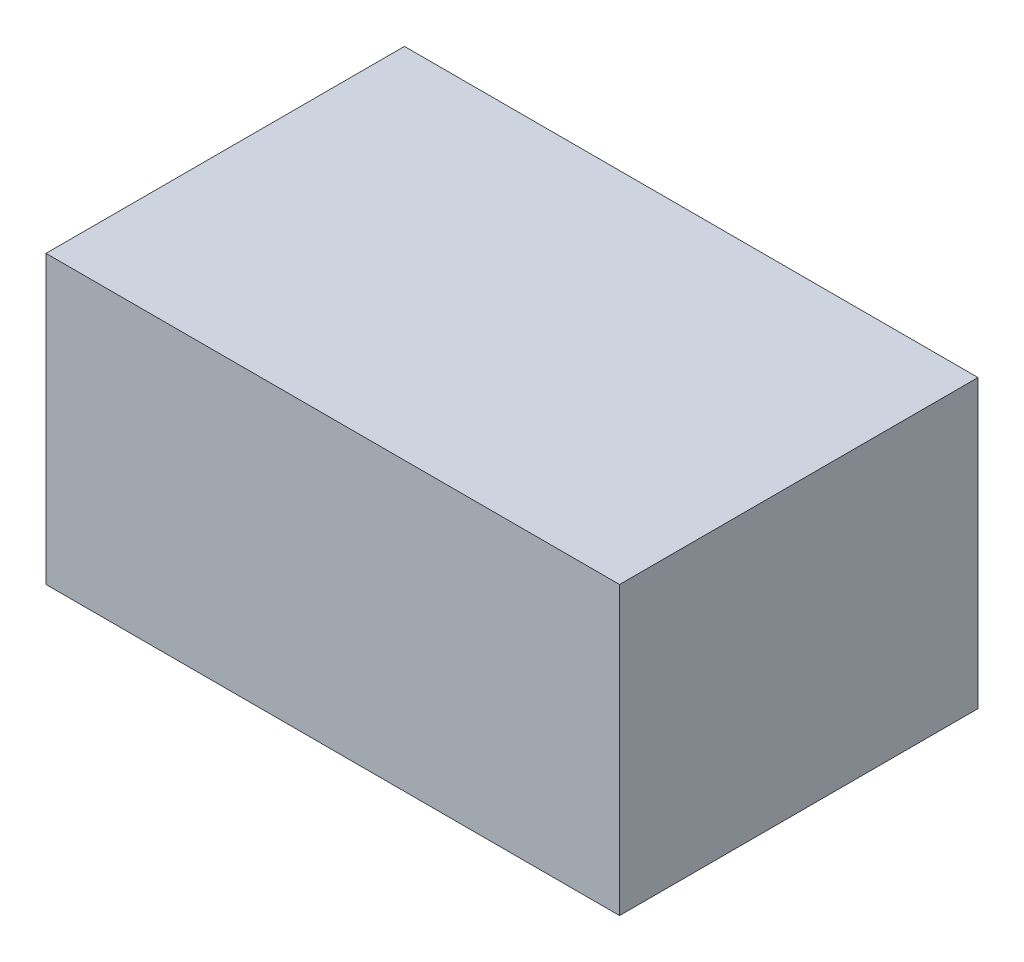
ISO-10303-21;
HEADER;
FILE_DESCRIPTION(('STEP AP214'),'2;1');
FILE_NAME('part.step','',(''),(''),'','','');
FILE_SCHEMA(('AUTOMOTIVE_DESIGN { 1 0 10303 214 1 1 1 1 }'));
ENDSEC;
DATA;
#1=APPLICATION_CONTEXT('core data for automotive mechanical design processes');
#2=APPLICATION_PROTOCOL_DEFINITION('international standard','automotive_design',2000,#1);
#3=PRODUCT_CONTEXT('',#1,'mechanical');
#4=PRODUCT('Part','Part','',(#3));
#5=PRODUCT_RELATED_PRODUCT_CATEGORY('part','',(#4));
#6=PRODUCT_DEFINITION_FORMATION('','',#4);
#7=PRODUCT_DEFINITION_CONTEXT('part definition',#1,'design');
#8=PRODUCT_DEFINITION('design','',#6,#7);
#9=PRODUCT_DEFINITION_SHAPE('','',#8);
#10=(LENGTH_UNIT() NAMED_UNIT(*) SI_UNIT(.MILLI.,.METRE.));
#11=(NAMED_UNIT(*) PLANE_ANGLE_UNIT() SI_UNIT($,.RADIAN.));
#12=(NAMED_UNIT(*) SI_UNIT($,.STERADIAN.) SOLID_ANGLE_UNIT());
#13=UNCERTAINTY_MEASURE_WITH_UNIT(LENGTH_MEASURE(1.E-05),#10,'distance_accuracy_value','');
#14=(GEOMETRIC_REPRESENTATION_CONTEXT(3) GLOBAL_UNCERTAINTY_ASSIGNED_CONTEXT((#13)) GLOBAL_UNIT_ASSIGNED_CONTEXT((#10,
#11,#12)) REPRESENTATION_CONTEXT('',''));
#15=CARTESIAN_POINT('',(0.,0.,0.));
#16=DIRECTION('',(0.,0.,1.));
#17=DIRECTION('',(1.,0.,0.));
#18=AXIS2_PLACEMENT_3D('',#15,#16,#17);
#19=CARTESIAN_POINT('',(-40.,40.,-25.));
#20=DIRECTION('',(1.,0.,0.));
#21=DIRECTION('',(0.,0.,-1.));
#22=AXIS2_PLACEMENT_3D('',#19,#20,#21);
#23=PLANE('',#22);
#24=DIRECTION('',(0.,0.,1.));
#25=VECTOR('',#24,1.);
#26=CARTESIAN_POINT('',(-40.,0.,-25.));
#27=LINE('',#26,#25);
#28=CARTESIAN_POINT('',(-40.,0.,-25.));
#29=VERTEX_POINT('',#28);
#30=CARTESIAN_POINT('',(-40.,0.,25.));
#31=VERTEX_POINT('',#30);
#32=EDGE_CURVE('E142',#29,#31,#27,.T.);
#33=ORIENTED_EDGE('',*,*,#32,.T.);
#34=DIRECTION('',(0.,-1.,0.));
#35=VECTOR('',#34,1.);
#36=CARTESIAN_POINT('',(-40.,40.,25.));
#37=LINE('',#36,#35);
#38=CARTESIAN_POINT('',(-40.,40.,25.));
#39=VERTEX_POINT('',#38);
#40=EDGE_CURVE('E11',#39,#31,#37,.T.);
#41=ORIENTED_EDGE('',*,*,#40,.F.);
#42=DIRECTION('',(0.,0.,1.));
#43=VECTOR('',#42,1.);
#44=CARTESIAN_POINT('',(-40.,40.,-25.));
#45=LINE('',#44,#43);
#46=CARTESIAN_POINT('',(-40.,40.,-25.));
#47=VERTEX_POINT('',#46);
#48=EDGE_CURVE('E146',#47,#39,#45,.T.);
#49=ORIENTED_EDGE('',*,*,#48,.F.);
#50=DIRECTION('',(0.,-1.,0.));
#51=VECTOR('',#50,1.);
#52=CARTESIAN_POINT('',(-40.,40.,-25.));
#53=LINE('',#52,#51);
#54=EDGE_CURVE('E152',#47,#29,#53,.T.);
#55=ORIENTED_EDGE('',*,*,#54,.T.);
#56=EDGE_LOOP('',(#33,#41,#49,#55));
#57=FACE_BOUND('',#56,.T.);
#58=ADVANCED_FACE('F34',(#57),#23,.F.);
#59=CARTESIAN_POINT('',(40.,40.,25.));
#60=DIRECTION('',(0.,0.,-1.));
#61=DIRECTION('',(-1.,0.,0.));
#62=AXIS2_PLACEMENT_3D('',#59,#60,#61);
#63=PLANE('',#62);
#64=DIRECTION('',(1.,0.,0.));
#65=VECTOR('',#64,1.);
#66=CARTESIAN_POINT('',(40.,0.,25.));
#67=LINE('',#66,#65);
#68=CARTESIAN_POINT('',(40.,0.,25.));
#69=VERTEX_POINT('',#68);
#70=EDGE_CURVE('E155',#31,#69,#67,.T.);
#71=ORIENTED_EDGE('',*,*,#70,.T.);
#72=DIRECTION('',(0.,-1.,0.));
#73=VECTOR('',#72,1.);
#74=CARTESIAN_POINT('',(40.,40.,25.));
#75=LINE('',#74,#73);
#76=CARTESIAN_POINT('',(40.,40.,25.));
#77=VERTEX_POINT('',#76);
#78=EDGE_CURVE('E41',#77,#69,#75,.T.);
#79=ORIENTED_EDGE('',*,*,#78,.F.);
#80=DIRECTION('',(1.,0.,0.));
#81=VECTOR('',#80,1.);
#82=CARTESIAN_POINT('',(40.,40.,25.));
#83=LINE('',#82,#81);
#84=EDGE_CURVE('E85',#39,#77,#83,.T.);
#85=ORIENTED_EDGE('',*,*,#84,.F.);
#86=ORIENTED_EDGE('',*,*,#40,.T.);
#87=EDGE_LOOP('',(#71,#79,#85,#86));
#88=FACE_BOUND('',#87,.T.);
#89=ADVANCED_FACE('F183',(#88),#63,.F.);
#90=CARTESIAN_POINT('',(40.,40.,-25.));
#91=DIRECTION('',(-1.,0.,0.));
#92=DIRECTION('',(0.,0.,1.));
#93=AXIS2_PLACEMENT_3D('',#90,#91,#92);
#94=PLANE('',#93);
#95=DIRECTION('',(0.,0.,-1.));
#96=VECTOR('',#95,1.);
#97=CARTESIAN_POINT('',(40.,0.,-25.));
#98=LINE('',#97,#96);
#99=CARTESIAN_POINT('',(40.,0.,-25.));
#100=VERTEX_POINT('',#99);
#101=EDGE_CURVE('E157',#69,#100,#98,.T.);
#102=ORIENTED_EDGE('',*,*,#101,.T.);
#103=DIRECTION('',(0.,-1.,0.));
#104=VECTOR('',#103,1.);
#105=CARTESIAN_POINT('',(40.,40.,-25.));
#106=LINE('',#105,#104);
#107=CARTESIAN_POINT('',(40.,40.,-25.));
#108=VERTEX_POINT('',#107);
#109=EDGE_CURVE('E161',#108,#100,#106,.T.);
#110=ORIENTED_EDGE('',*,*,#109,.F.);
#111=DIRECTION('',(0.,0.,-1.));
#112=VECTOR('',#111,1.);
#113=CARTESIAN_POINT('',(40.,40.,-25.));
#114=LINE('',#113,#112);
#115=EDGE_CURVE('E149',#77,#108,#114,.T.);
#116=ORIENTED_EDGE('',*,*,#115,.F.);
#117=ORIENTED_EDGE('',*,*,#78,.T.);
#118=EDGE_LOOP('',(#102,#110,#116,#117));
#119=FACE_BOUND('',#118,.T.);
#120=ADVANCED_FACE('F166',(#119),#94,.F.);
#121=CARTESIAN_POINT('',(40.,40.,-25.));
#122=DIRECTION('',(0.,0.,1.));
#123=DIRECTION('',(1.,0.,0.));
#124=AXIS2_PLACEMENT_3D('',#121,#122,#123);
#125=PLANE('',#124);
#126=DIRECTION('',(-1.,0.,0.));
#127=VECTOR('',#126,1.);
#128=CARTESIAN_POINT('',(40.,0.,-25.));
#129=LINE('',#128,#127);
#130=EDGE_CURVE('E78',#100,#29,#129,.T.);
#131=ORIENTED_EDGE('',*,*,#130,.T.);
#132=ORIENTED_EDGE('',*,*,#54,.F.);
#133=DIRECTION('',(-1.,0.,0.));
#134=VECTOR('',#133,1.);
#135=CARTESIAN_POINT('',(40.,40.,-25.));
#136=LINE('',#135,#134);
#137=EDGE_CURVE('E57',#108,#47,#136,.T.);
#138=ORIENTED_EDGE('',*,*,#137,.F.);
#139=ORIENTED_EDGE('',*,*,#109,.T.);
#140=EDGE_LOOP('',(#131,#132,#138,#139));
#141=FACE_BOUND('',#140,.T.);
#142=ADVANCED_FACE('F174',(#141),#125,.F.);
#143=CARTESIAN_POINT('',(0.,40.,0.));
#144=DIRECTION('',(0.,-1.,0.));
#145=DIRECTION('',(0.,0.,-1.));
#146=AXIS2_PLACEMENT_3D('',#143,#144,#145);
#147=PLANE('',#146);
#148=ORIENTED_EDGE('',*,*,#48,.T.);
#149=ORIENTED_EDGE('',*,*,#84,.T.);
#150=ORIENTED_EDGE('',*,*,#115,.T.);
#151=ORIENTED_EDGE('',*,*,#137,.T.);
#152=EDGE_LOOP('',(#148,#149,#150,#151));
#153=FACE_BOUND('',#152,.T.);
#154=ADVANCED_FACE('F176',(#153),#147,.F.);
#155=CARTESIAN_POINT('',(0.,0.,0.));
#156=DIRECTION('',(0.,-1.,0.));
#157=DIRECTION('',(0.,0.,-1.));
#158=AXIS2_PLACEMENT_3D('',#155,#156,#157);
#159=PLANE('',#158);
#160=DIRECTION('',(-1.,0.,0.));
#161=VECTOR('',#160,1.);
#162=CARTESIAN_POINT('',(34.,0.,19.));
#163=LINE('',#162,#161);
#164=CARTESIAN_POINT('',(34.,0.,19.));
#165=VERTEX_POINT('',#164);
#166=CARTESIAN_POINT('',(-34.,0.,19.));
#167=VERTEX_POINT('',#166);
#168=EDGE_CURVE('E48',#165,#167,#163,.T.);
#169=ORIENTED_EDGE('',*,*,#168,.F.);
#170=DIRECTION('',(0.,0.,1.));
#171=VECTOR('',#170,1.);
#172=CARTESIAN_POINT('',(34.,0.,-19.));
#173=LINE('',#172,#171);
#174=CARTESIAN_POINT('',(34.,0.,-19.));
#175=VERTEX_POINT('',#174);
#176=EDGE_CURVE('E127',#175,#165,#173,.T.);
#177=ORIENTED_EDGE('',*,*,#176,.F.);
#178=DIRECTION('',(1.,0.,0.));
#179=VECTOR('',#178,1.);
#180=CARTESIAN_POINT('',(-34.,0.,-19.));
#181=LINE('',#180,#179);
#182=CARTESIAN_POINT('',(-34.,0.,-19.));
#183=VERTEX_POINT('',#182);
#184=EDGE_CURVE('E130',#183,#175,#181,.T.);
#185=ORIENTED_EDGE('',*,*,#184,.F.);
#186=DIRECTION('',(0.,0.,-1.));
#187=VECTOR('',#186,1.);
#188=CARTESIAN_POINT('',(-34.,0.,19.));
#189=LINE('',#188,#187);
#190=EDGE_CURVE('E136',#167,#183,#189,.T.);
#191=ORIENTED_EDGE('',*,*,#190,.F.);
#192=EDGE_LOOP('',(#169,#177,#185,#191));
#193=FACE_BOUND('',#192,.T.);
#194=ORIENTED_EDGE('',*,*,#32,.F.);
#195=ORIENTED_EDGE('',*,*,#130,.F.);
#196=ORIENTED_EDGE('',*,*,#101,.F.);
#197=ORIENTED_EDGE('',*,*,#70,.F.);
#198=EDGE_LOOP('',(#194,#195,#196,#197));
#199=FACE_BOUND('',#198,.T.);
#200=ADVANCED_FACE('F170',(#193,#199),#159,.T.);
#201=CARTESIAN_POINT('',(34.,6.,19.));
#202=DIRECTION('',(0.,0.,1.));
#203=DIRECTION('',(1.,0.,0.));
#204=AXIS2_PLACEMENT_3D('',#201,#202,#203);
#205=PLANE('',#204);
#206=ORIENTED_EDGE('',*,*,#168,.T.);
#207=DIRECTION('',(0.,-1.,0.));
#208=VECTOR('',#207,1.);
#209=CARTESIAN_POINT('',(-34.,6.,19.));
#210=LINE('',#209,#208);
#211=CARTESIAN_POINT('',(-34.,6.,19.));
#212=VERTEX_POINT('',#211);
#213=EDGE_CURVE('E105',#212,#167,#210,.T.);
#214=ORIENTED_EDGE('',*,*,#213,.F.);
#215=DIRECTION('',(-1.,0.,0.));
#216=VECTOR('',#215,1.);
#217=CARTESIAN_POINT('',(34.,6.,19.));
#218=LINE('',#217,#216);
#219=CARTESIAN_POINT('',(34.,6.,19.));
#220=VERTEX_POINT('',#219);
#221=EDGE_CURVE('E109',#220,#212,#218,.T.);
#222=ORIENTED_EDGE('',*,*,#221,.F.);
#223=DIRECTION('',(0.,-1.,0.));
#224=VECTOR('',#223,1.);
#225=CARTESIAN_POINT('',(34.,6.,19.));
#226=LINE('',#225,#224);
#227=EDGE_CURVE('E140',#220,#165,#226,.T.);
#228=ORIENTED_EDGE('',*,*,#227,.T.);
#229=EDGE_LOOP('',(#206,#214,#222,#228));
#230=FACE_BOUND('',#229,.T.);
#231=ADVANCED_FACE('F107',(#230),#205,.F.);
#232=CARTESIAN_POINT('',(34.,6.,-19.));
#233=DIRECTION('',(1.,0.,0.));
#234=DIRECTION('',(0.,0.,-1.));
#235=AXIS2_PLACEMENT_3D('',#232,#233,#234);
#236=PLANE('',#235);
#237=ORIENTED_EDGE('',*,*,#176,.T.);
#238=ORIENTED_EDGE('',*,*,#227,.F.);
#239=DIRECTION('',(0.,0.,1.));
#240=VECTOR('',#239,1.);
#241=CARTESIAN_POINT('',(34.,6.,-19.));
#242=LINE('',#241,#240);
#243=CARTESIAN_POINT('',(34.,6.,-19.));
#244=VERTEX_POINT('',#243);
#245=EDGE_CURVE('E115',#244,#220,#242,.T.);
#246=ORIENTED_EDGE('',*,*,#245,.F.);
#247=DIRECTION('',(0.,-1.,0.));
#248=VECTOR('',#247,1.);
#249=CARTESIAN_POINT('',(34.,6.,-19.));
#250=LINE('',#249,#248);
#251=EDGE_CURVE('E143',#244,#175,#250,.T.);
#252=ORIENTED_EDGE('',*,*,#251,.T.);
#253=EDGE_LOOP('',(#237,#238,#246,#252));
#254=FACE_BOUND('',#253,.T.);
#255=ADVANCED_FACE('F224',(#254),#236,.F.);
#256=CARTESIAN_POINT('',(-34.,6.,-19.));
#257=DIRECTION('',(0.,0.,-1.));
#258=DIRECTION('',(-1.,0.,0.));
#259=AXIS2_PLACEMENT_3D('',#256,#257,#258);
#260=PLANE('',#259);
#261=ORIENTED_EDGE('',*,*,#184,.T.);
#262=ORIENTED_EDGE('',*,*,#251,.F.);
#263=DIRECTION('',(1.,0.,0.));
#264=VECTOR('',#263,1.);
#265=CARTESIAN_POINT('',(-34.,6.,-19.));
#266=LINE('',#265,#264);
#267=CARTESIAN_POINT('',(-34.,6.,-19.));
#268=VERTEX_POINT('',#267);
#269=EDGE_CURVE('E123',#268,#244,#266,.T.);
#270=ORIENTED_EDGE('',*,*,#269,.F.);
#271=DIRECTION('',(0.,-1.,0.));
#272=VECTOR('',#271,1.);
#273=CARTESIAN_POINT('',(-34.,6.,-19.));
#274=LINE('',#273,#272);
#275=EDGE_CURVE('E114',#268,#183,#274,.T.);
#276=ORIENTED_EDGE('',*,*,#275,.T.);
#277=EDGE_LOOP('',(#261,#262,#270,#276));
#278=FACE_BOUND('',#277,.T.);
#279=ADVANCED_FACE('F235',(#278),#260,.F.);
#280=CARTESIAN_POINT('',(-34.,6.,19.));
#281=DIRECTION('',(-1.,0.,0.));
#282=DIRECTION('',(0.,0.,1.));
#283=AXIS2_PLACEMENT_3D('',#280,#281,#282);
#284=PLANE('',#283);
#285=ORIENTED_EDGE('',*,*,#190,.T.);
#286=ORIENTED_EDGE('',*,*,#275,.F.);
#287=DIRECTION('',(0.,0.,-1.));
#288=VECTOR('',#287,1.);
#289=CARTESIAN_POINT('',(-34.,6.,19.));
#290=LINE('',#289,#288);
#291=EDGE_CURVE('E118',#212,#268,#290,.T.);
#292=ORIENTED_EDGE('',*,*,#291,.F.);
#293=ORIENTED_EDGE('',*,*,#213,.T.);
#294=EDGE_LOOP('',(#285,#286,#292,#293));
#295=FACE_BOUND('',#294,.T.);
#296=ADVANCED_FACE('F119',(#295),#284,.F.);
#297=CARTESIAN_POINT('',(0.,6.,0.));
#298=DIRECTION('',(0.,-1.,0.));
#299=DIRECTION('',(0.,0.,-1.));
#300=AXIS2_PLACEMENT_3D('',#297,#298,#299);
#301=PLANE('',#300);
#302=ORIENTED_EDGE('',*,*,#221,.T.);
#303=ORIENTED_EDGE('',*,*,#291,.T.);
#304=ORIENTED_EDGE('',*,*,#269,.T.);
#305=ORIENTED_EDGE('',*,*,#245,.T.);
#306=EDGE_LOOP('',(#302,#303,#304,#305));
#307=FACE_BOUND('',#306,.T.);
#308=ADVANCED_FACE('F125',(#307),#301,.T.);
#309=CLOSED_SHELL('',(#58,#89,#120,#142,#154,#200,#231,#255,#279,#296,#308));
#310=MANIFOLD_SOLID_BREP('B2',#309);
#311=ADVANCED_BREP_SHAPE_REPRESENTATION('',(#18,#310),#14);
#312=SHAPE_DEFINITION_REPRESENTATION(#9,#311);
ENDSEC;
END-ISO-10303-21;
